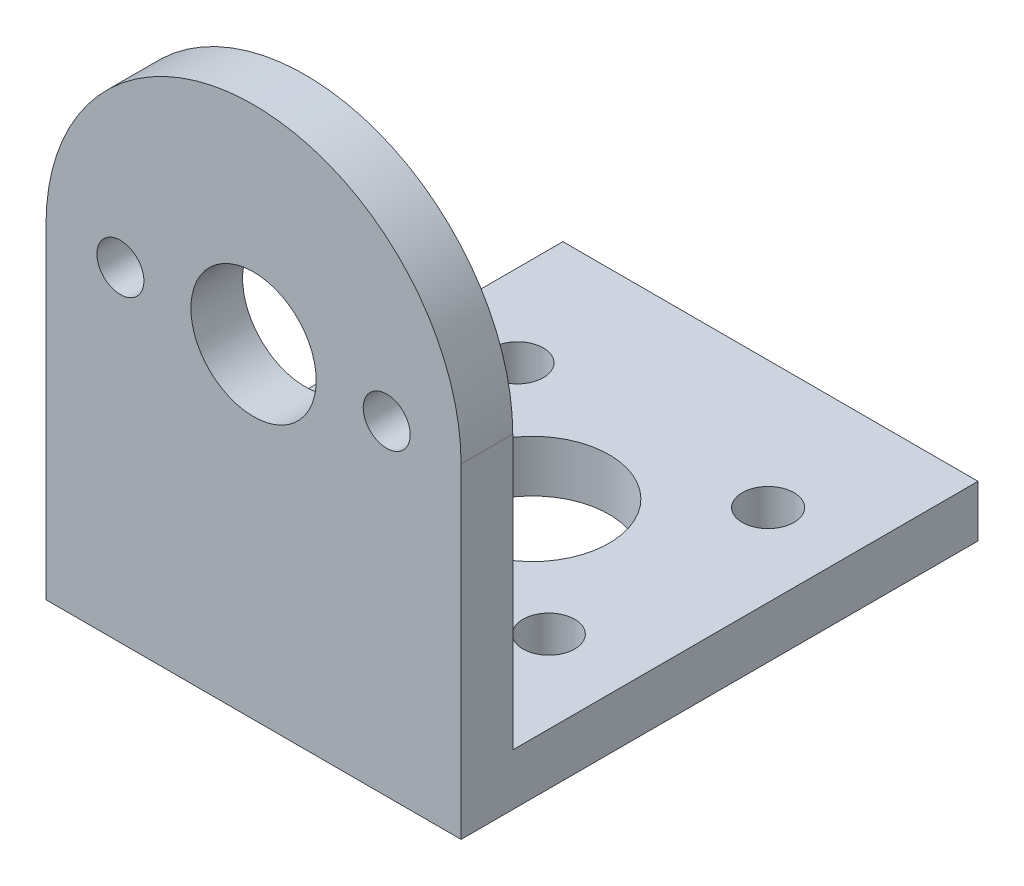
ISO-10303-21;
HEADER;
FILE_DESCRIPTION(('STEP AP214'),'2;1');
FILE_NAME('part.step','',(''),(''),'','','');
FILE_SCHEMA(('AUTOMOTIVE_DESIGN { 1 0 10303 214 1 1 1 1 }'));
ENDSEC;
DATA;
#1=APPLICATION_CONTEXT('core data for automotive mechanical design processes');
#2=APPLICATION_PROTOCOL_DEFINITION('international standard','automotive_design',2000,#1);
#3=PRODUCT_CONTEXT('',#1,'mechanical');
#4=PRODUCT('Part','Part','',(#3));
#5=PRODUCT_RELATED_PRODUCT_CATEGORY('part','',(#4));
#6=PRODUCT_DEFINITION_FORMATION('','',#4);
#7=PRODUCT_DEFINITION_CONTEXT('part definition',#1,'design');
#8=PRODUCT_DEFINITION('design','',#6,#7);
#9=PRODUCT_DEFINITION_SHAPE('','',#8);
#10=(LENGTH_UNIT() NAMED_UNIT(*) SI_UNIT(.MILLI.,.METRE.));
#11=(NAMED_UNIT(*) PLANE_ANGLE_UNIT() SI_UNIT($,.RADIAN.));
#12=(NAMED_UNIT(*) SI_UNIT($,.STERADIAN.) SOLID_ANGLE_UNIT());
#13=UNCERTAINTY_MEASURE_WITH_UNIT(LENGTH_MEASURE(1.E-05),#10,'distance_accuracy_value','');
#14=(GEOMETRIC_REPRESENTATION_CONTEXT(3) GLOBAL_UNCERTAINTY_ASSIGNED_CONTEXT((#13)) GLOBAL_UNIT_ASSIGNED_CONTEXT((#10,
#11,#12)) REPRESENTATION_CONTEXT('',''));
#15=CARTESIAN_POINT('',(0.,0.,0.));
#16=DIRECTION('',(0.,0.,1.));
#17=DIRECTION('',(1.,0.,0.));
#18=AXIS2_PLACEMENT_3D('',#15,#16,#17);
#19=CARTESIAN_POINT('',(0.,0.,0.));
#20=DIRECTION('',(0.,0.,-1.));
#21=DIRECTION('',(-1.,0.,0.));
#22=AXIS2_PLACEMENT_3D('',#19,#20,#21);
#23=PLANE('',#22);
#24=CARTESIAN_POINT('',(-8.5,0.,0.));
#25=DIRECTION('',(0.,0.,1.));
#26=DIRECTION('',(1.,0.,0.));
#27=AXIS2_PLACEMENT_3D('',#24,#25,#26);
#28=CIRCLE('',#27,1.5);
#29=CARTESIAN_POINT('',(-7.,0.,0.));
#30=VERTEX_POINT('',#29);
#31=EDGE_CURVE('E130',#30,#30,#28,.T.);
#32=ORIENTED_EDGE('',*,*,#31,.T.);
#33=EDGE_LOOP('',(#32));
#34=FACE_BOUND('',#33,.T.);
#35=CARTESIAN_POINT('',(0.,0.,0.));
#36=DIRECTION('',(0.,0.,1.));
#37=DIRECTION('',(1.,0.,0.));
#38=AXIS2_PLACEMENT_3D('',#35,#36,#37);
#39=CIRCLE('',#38,4.);
#40=CARTESIAN_POINT('',(4.,0.,0.));
#41=VERTEX_POINT('',#40);
#42=EDGE_CURVE('E136',#41,#41,#39,.T.);
#43=ORIENTED_EDGE('',*,*,#42,.T.);
#44=EDGE_LOOP('',(#43));
#45=FACE_BOUND('',#44,.T.);
#46=CARTESIAN_POINT('',(8.5,0.,0.));
#47=DIRECTION('',(0.,0.,1.));
#48=DIRECTION('',(-1.,0.,0.));
#49=AXIS2_PLACEMENT_3D('',#46,#47,#48);
#50=CIRCLE('',#49,1.5);
#51=CARTESIAN_POINT('',(7.,0.,0.));
#52=VERTEX_POINT('',#51);
#53=EDGE_CURVE('E125',#52,#52,#50,.T.);
#54=ORIENTED_EDGE('',*,*,#53,.T.);
#55=EDGE_LOOP('',(#54));
#56=FACE_BOUND('',#55,.T.);
#57=DIRECTION('',(0.,1.,0.));
#58=VECTOR('',#57,1.);
#59=CARTESIAN_POINT('',(13.25,0.,0.));
#60=LINE('',#59,#58);
#61=CARTESIAN_POINT('',(13.25,-17.45,0.));
#62=VERTEX_POINT('',#61);
#63=CARTESIAN_POINT('',(13.25,0.,0.));
#64=VERTEX_POINT('',#63);
#65=EDGE_CURVE('E76',#62,#64,#60,.T.);
#66=ORIENTED_EDGE('',*,*,#65,.F.);
#67=DIRECTION('',(-1.,0.,0.));
#68=VECTOR('',#67,1.);
#69=CARTESIAN_POINT('',(13.25,-17.45,0.));
#70=LINE('',#69,#68);
#71=CARTESIAN_POINT('',(-13.25,-17.45,0.));
#72=VERTEX_POINT('',#71);
#73=EDGE_CURVE('E100',#62,#72,#70,.T.);
#74=ORIENTED_EDGE('',*,*,#73,.T.);
#75=DIRECTION('',(0.,-1.,0.));
#76=VECTOR('',#75,1.);
#77=CARTESIAN_POINT('',(-13.25,0.,0.));
#78=LINE('',#77,#76);
#79=CARTESIAN_POINT('',(-13.25,0.,0.));
#80=VERTEX_POINT('',#79);
#81=EDGE_CURVE('E154',#80,#72,#78,.T.);
#82=ORIENTED_EDGE('',*,*,#81,.F.);
#83=CARTESIAN_POINT('',(0.,0.,0.));
#84=DIRECTION('',(0.,0.,1.));
#85=DIRECTION('',(-1.,0.,0.));
#86=AXIS2_PLACEMENT_3D('',#83,#84,#85);
#87=CIRCLE('',#86,13.25);
#88=EDGE_CURVE('E142',#64,#80,#87,.T.);
#89=ORIENTED_EDGE('',*,*,#88,.F.);
#90=EDGE_LOOP('',(#66,#74,#82,#89));
#91=FACE_BOUND('',#90,.T.);
#92=ADVANCED_FACE('F37',(#34,#45,#56,#91),#23,.T.);
#93=CARTESIAN_POINT('',(0.,0.,3.3));
#94=DIRECTION('',(0.,0.,-1.));
#95=DIRECTION('',(-1.,0.,0.));
#96=AXIS2_PLACEMENT_3D('',#93,#94,#95);
#97=PLANE('',#96);
#98=CARTESIAN_POINT('',(0.,0.,3.3));
#99=DIRECTION('',(0.,0.,1.));
#100=DIRECTION('',(-1.,0.,0.));
#101=AXIS2_PLACEMENT_3D('',#98,#99,#100);
#102=CIRCLE('',#101,13.25);
#103=CARTESIAN_POINT('',(13.25,0.,3.3));
#104=VERTEX_POINT('',#103);
#105=CARTESIAN_POINT('',(-13.25,0.,3.3));
#106=VERTEX_POINT('',#105);
#107=EDGE_CURVE('E145',#104,#106,#102,.T.);
#108=ORIENTED_EDGE('',*,*,#107,.T.);
#109=DIRECTION('',(0.,-1.,0.));
#110=VECTOR('',#109,1.);
#111=CARTESIAN_POINT('',(-13.25,0.,3.3));
#112=LINE('',#111,#110);
#113=CARTESIAN_POINT('',(-13.25,-20.75,3.3));
#114=VERTEX_POINT('',#113);
#115=EDGE_CURVE('E83',#106,#114,#112,.T.);
#116=ORIENTED_EDGE('',*,*,#115,.T.);
#117=DIRECTION('',(1.,0.,0.));
#118=VECTOR('',#117,1.);
#119=CARTESIAN_POINT('',(-13.25,-20.75,3.3));
#120=LINE('',#119,#118);
#121=CARTESIAN_POINT('',(13.25,-20.75,3.3));
#122=VERTEX_POINT('',#121);
#123=EDGE_CURVE('E148',#114,#122,#120,.T.);
#124=ORIENTED_EDGE('',*,*,#123,.T.);
#125=DIRECTION('',(0.,1.,0.));
#126=VECTOR('',#125,1.);
#127=CARTESIAN_POINT('',(13.25,0.,3.3));
#128=LINE('',#127,#126);
#129=EDGE_CURVE('E61',#122,#104,#128,.T.);
#130=ORIENTED_EDGE('',*,*,#129,.T.);
#131=EDGE_LOOP('',(#108,#116,#124,#130));
#132=FACE_BOUND('',#131,.T.);
#133=CARTESIAN_POINT('',(0.,0.,3.3));
#134=DIRECTION('',(0.,0.,1.));
#135=DIRECTION('',(1.,0.,0.));
#136=AXIS2_PLACEMENT_3D('',#133,#134,#135);
#137=CIRCLE('',#136,4.);
#138=CARTESIAN_POINT('',(4.,0.,3.3));
#139=VERTEX_POINT('',#138);
#140=EDGE_CURVE('E139',#139,#139,#137,.T.);
#141=ORIENTED_EDGE('',*,*,#140,.F.);
#142=EDGE_LOOP('',(#141));
#143=FACE_BOUND('',#142,.T.);
#144=CARTESIAN_POINT('',(-8.5,0.,3.3));
#145=DIRECTION('',(0.,0.,1.));
#146=DIRECTION('',(1.,0.,0.));
#147=AXIS2_PLACEMENT_3D('',#144,#145,#146);
#148=CIRCLE('',#147,1.5);
#149=CARTESIAN_POINT('',(-7.,0.,3.3));
#150=VERTEX_POINT('',#149);
#151=EDGE_CURVE('E133',#150,#150,#148,.T.);
#152=ORIENTED_EDGE('',*,*,#151,.F.);
#153=EDGE_LOOP('',(#152));
#154=FACE_BOUND('',#153,.T.);
#155=CARTESIAN_POINT('',(8.5,0.,3.3));
#156=DIRECTION('',(0.,0.,1.));
#157=DIRECTION('',(-1.,0.,0.));
#158=AXIS2_PLACEMENT_3D('',#155,#156,#157);
#159=CIRCLE('',#158,1.5);
#160=CARTESIAN_POINT('',(7.,0.,3.3));
#161=VERTEX_POINT('',#160);
#162=EDGE_CURVE('E127',#161,#161,#159,.T.);
#163=ORIENTED_EDGE('',*,*,#162,.F.);
#164=EDGE_LOOP('',(#163));
#165=FACE_BOUND('',#164,.T.);
#166=ADVANCED_FACE('F168',(#132,#143,#154,#165),#97,.F.);
#167=CARTESIAN_POINT('',(0.,0.,3.3));
#168=DIRECTION('',(0.,0.,-1.));
#169=DIRECTION('',(-1.,0.,0.));
#170=AXIS2_PLACEMENT_3D('',#167,#168,#169);
#171=CYLINDRICAL_SURFACE('',#170,13.25);
#172=ORIENTED_EDGE('',*,*,#88,.T.);
#173=DIRECTION('',(0.,0.,-1.));
#174=VECTOR('',#173,1.);
#175=CARTESIAN_POINT('',(-13.25,0.,3.3));
#176=LINE('',#175,#174);
#177=EDGE_CURVE('E11',#106,#80,#176,.T.);
#178=ORIENTED_EDGE('',*,*,#177,.F.);
#179=ORIENTED_EDGE('',*,*,#107,.F.);
#180=DIRECTION('',(0.,0.,-1.));
#181=VECTOR('',#180,1.);
#182=CARTESIAN_POINT('',(13.25,0.,3.3));
#183=LINE('',#182,#181);
#184=EDGE_CURVE('E151',#104,#64,#183,.T.);
#185=ORIENTED_EDGE('',*,*,#184,.T.);
#186=EDGE_LOOP('',(#172,#178,#179,#185));
#187=FACE_BOUND('',#186,.T.);
#188=ADVANCED_FACE('F39',(#187),#171,.T.);
#189=CARTESIAN_POINT('',(-13.25,0.,3.3));
#190=DIRECTION('',(1.,0.,0.));
#191=DIRECTION('',(0.,1.,0.));
#192=AXIS2_PLACEMENT_3D('',#189,#190,#191);
#193=PLANE('',#192);
#194=ORIENTED_EDGE('',*,*,#81,.T.);
#195=DIRECTION('',(0.,0.,1.));
#196=VECTOR('',#195,1.);
#197=CARTESIAN_POINT('',(-13.25,-17.45,-29.7));
#198=LINE('',#197,#196);
#199=CARTESIAN_POINT('',(-13.25,-17.45,-29.7));
#200=VERTEX_POINT('',#199);
#201=EDGE_CURVE('E52',#200,#72,#198,.T.);
#202=ORIENTED_EDGE('',*,*,#201,.F.);
#203=DIRECTION('',(0.,-1.,0.));
#204=VECTOR('',#203,1.);
#205=CARTESIAN_POINT('',(-13.25,-20.75,-29.7));
#206=LINE('',#205,#204);
#207=CARTESIAN_POINT('',(-13.25,-20.75,-29.7));
#208=VERTEX_POINT('',#207);
#209=EDGE_CURVE('E112',#200,#208,#206,.T.);
#210=ORIENTED_EDGE('',*,*,#209,.T.);
#211=DIRECTION('',(0.,0.,-1.));
#212=VECTOR('',#211,1.);
#213=CARTESIAN_POINT('',(-13.25,-20.75,3.3));
#214=LINE('',#213,#212);
#215=EDGE_CURVE('E45',#114,#208,#214,.T.);
#216=ORIENTED_EDGE('',*,*,#215,.F.);
#217=ORIENTED_EDGE('',*,*,#115,.F.);
#218=ORIENTED_EDGE('',*,*,#177,.T.);
#219=EDGE_LOOP('',(#194,#202,#210,#216,#217,#218));
#220=FACE_BOUND('',#219,.T.);
#221=ADVANCED_FACE('F162',(#220),#193,.F.);
#222=CARTESIAN_POINT('',(-13.25,-20.75,3.3));
#223=DIRECTION('',(0.,1.,0.));
#224=DIRECTION('',(0.,0.,1.));
#225=AXIS2_PLACEMENT_3D('',#222,#223,#224);
#226=PLANE('',#225);
#227=CARTESIAN_POINT('',(8.,-20.75,-21.55));
#228=DIRECTION('',(0.,1.,0.));
#229=DIRECTION('',(0.,0.,1.));
#230=AXIS2_PLACEMENT_3D('',#227,#228,#229);
#231=CIRCLE('',#230,1.65);
#232=CARTESIAN_POINT('',(8.,-20.75,-19.9));
#233=VERTEX_POINT('',#232);
#234=EDGE_CURVE('E333',#233,#233,#231,.F.);
#235=ORIENTED_EDGE('',*,*,#234,.F.);
#236=EDGE_LOOP('',(#235));
#237=FACE_BOUND('',#236,.T.);
#238=CARTESIAN_POINT('',(8.,-20.75,-7.55));
#239=DIRECTION('',(0.,1.,0.));
#240=DIRECTION('',(0.,0.,1.));
#241=AXIS2_PLACEMENT_3D('',#238,#239,#240);
#242=CIRCLE('',#241,1.65);
#243=CARTESIAN_POINT('',(8.,-20.75,-5.9));
#244=VERTEX_POINT('',#243);
#245=EDGE_CURVE('E341',#244,#244,#242,.F.);
#246=ORIENTED_EDGE('',*,*,#245,.F.);
#247=EDGE_LOOP('',(#246));
#248=FACE_BOUND('',#247,.T.);
#249=CARTESIAN_POINT('',(-7.99999999999999,-20.75,-7.55));
#250=DIRECTION('',(0.,1.,0.));
#251=DIRECTION('',(0.,0.,1.));
#252=AXIS2_PLACEMENT_3D('',#249,#250,#251);
#253=CIRCLE('',#252,1.65);
#254=CARTESIAN_POINT('',(-7.99999999999999,-20.75,-5.9));
#255=VERTEX_POINT('',#254);
#256=EDGE_CURVE('E354',#255,#255,#253,.F.);
#257=ORIENTED_EDGE('',*,*,#256,.F.);
#258=EDGE_LOOP('',(#257));
#259=FACE_BOUND('',#258,.T.);
#260=CARTESIAN_POINT('',(-8.,-20.75,-21.55));
#261=DIRECTION('',(0.,1.,0.));
#262=DIRECTION('',(0.,0.,1.));
#263=AXIS2_PLACEMENT_3D('',#260,#261,#262);
#264=CIRCLE('',#263,1.65);
#265=CARTESIAN_POINT('',(-8.,-20.75,-19.9));
#266=VERTEX_POINT('',#265);
#267=EDGE_CURVE('E345',#266,#266,#264,.F.);
#268=ORIENTED_EDGE('',*,*,#267,.F.);
#269=EDGE_LOOP('',(#268));
#270=FACE_BOUND('',#269,.T.);
#271=CARTESIAN_POINT('',(0.,-20.75,-14.5));
#272=DIRECTION('',(0.,1.,0.));
#273=DIRECTION('',(0.,0.,1.));
#274=AXIS2_PLACEMENT_3D('',#271,#272,#273);
#275=CIRCLE('',#274,4.9);
#276=CARTESIAN_POINT('',(0.,-20.75,-9.6));
#277=VERTEX_POINT('',#276);
#278=EDGE_CURVE('E118',#277,#277,#275,.F.);
#279=ORIENTED_EDGE('',*,*,#278,.F.);
#280=EDGE_LOOP('',(#279));
#281=FACE_BOUND('',#280,.T.);
#282=ORIENTED_EDGE('',*,*,#215,.T.);
#283=DIRECTION('',(1.,0.,0.));
#284=VECTOR('',#283,1.);
#285=CARTESIAN_POINT('',(13.25,-20.75,-29.7));
#286=LINE('',#285,#284);
#287=CARTESIAN_POINT('',(13.25,-20.75,-29.7));
#288=VERTEX_POINT('',#287);
#289=EDGE_CURVE('E102',#208,#288,#286,.T.);
#290=ORIENTED_EDGE('',*,*,#289,.T.);
#291=DIRECTION('',(0.,0.,-1.));
#292=VECTOR('',#291,1.);
#293=CARTESIAN_POINT('',(13.25,-20.75,3.3));
#294=LINE('',#293,#292);
#295=EDGE_CURVE('E116',#122,#288,#294,.T.);
#296=ORIENTED_EDGE('',*,*,#295,.F.);
#297=ORIENTED_EDGE('',*,*,#123,.F.);
#298=EDGE_LOOP('',(#282,#290,#296,#297));
#299=FACE_BOUND('',#298,.T.);
#300=ADVANCED_FACE('F161',(#237,#248,#259,#270,#281,#299),#226,.F.);
#301=CARTESIAN_POINT('',(13.25,0.,3.3));
#302=DIRECTION('',(-1.,0.,0.));
#303=DIRECTION('',(0.,-1.,0.));
#304=AXIS2_PLACEMENT_3D('',#301,#302,#303);
#305=PLANE('',#304);
#306=ORIENTED_EDGE('',*,*,#295,.T.);
#307=DIRECTION('',(0.,1.,0.));
#308=VECTOR('',#307,1.);
#309=CARTESIAN_POINT('',(13.25,-20.75,-29.7));
#310=LINE('',#309,#308);
#311=CARTESIAN_POINT('',(13.25,-17.45,-29.7));
#312=VERTEX_POINT('',#311);
#313=EDGE_CURVE('E109',#288,#312,#310,.T.);
#314=ORIENTED_EDGE('',*,*,#313,.T.);
#315=DIRECTION('',(0.,0.,1.));
#316=VECTOR('',#315,1.);
#317=CARTESIAN_POINT('',(13.25,-17.45,-29.7));
#318=LINE('',#317,#316);
#319=EDGE_CURVE('E96',#312,#62,#318,.T.);
#320=ORIENTED_EDGE('',*,*,#319,.T.);
#321=ORIENTED_EDGE('',*,*,#65,.T.);
#322=ORIENTED_EDGE('',*,*,#184,.F.);
#323=ORIENTED_EDGE('',*,*,#129,.F.);
#324=EDGE_LOOP('',(#306,#314,#320,#321,#322,#323));
#325=FACE_BOUND('',#324,.T.);
#326=ADVANCED_FACE('F114',(#325),#305,.F.);
#327=CARTESIAN_POINT('',(0.,0.,3.3));
#328=DIRECTION('',(0.,0.,-1.));
#329=DIRECTION('',(-1.,0.,0.));
#330=AXIS2_PLACEMENT_3D('',#327,#328,#329);
#331=CYLINDRICAL_SURFACE('',#330,4.);
#332=ORIENTED_EDGE('',*,*,#140,.T.);
#333=EDGE_LOOP('',(#332));
#334=FACE_BOUND('',#333,.T.);
#335=ORIENTED_EDGE('',*,*,#42,.F.);
#336=EDGE_LOOP('',(#335));
#337=FACE_BOUND('',#336,.T.);
#338=ADVANCED_FACE('F195',(#334,#337),#331,.F.);
#339=CARTESIAN_POINT('',(-8.5,0.,3.3));
#340=DIRECTION('',(0.,0.,-1.));
#341=DIRECTION('',(-1.,0.,0.));
#342=AXIS2_PLACEMENT_3D('',#339,#340,#341);
#343=CYLINDRICAL_SURFACE('',#342,1.5);
#344=ORIENTED_EDGE('',*,*,#151,.T.);
#345=EDGE_LOOP('',(#344));
#346=FACE_BOUND('',#345,.T.);
#347=ORIENTED_EDGE('',*,*,#31,.F.);
#348=EDGE_LOOP('',(#347));
#349=FACE_BOUND('',#348,.T.);
#350=ADVANCED_FACE('F181',(#346,#349),#343,.F.);
#351=CARTESIAN_POINT('',(8.5,0.,3.3));
#352=DIRECTION('',(0.,0.,-1.));
#353=DIRECTION('',(-1.,0.,0.));
#354=AXIS2_PLACEMENT_3D('',#351,#352,#353);
#355=CYLINDRICAL_SURFACE('',#354,1.5);
#356=ORIENTED_EDGE('',*,*,#162,.T.);
#357=EDGE_LOOP('',(#356));
#358=FACE_BOUND('',#357,.T.);
#359=ORIENTED_EDGE('',*,*,#53,.F.);
#360=EDGE_LOOP('',(#359));
#361=FACE_BOUND('',#360,.T.);
#362=ADVANCED_FACE('F178',(#358,#361),#355,.F.);
#363=CARTESIAN_POINT('',(13.25,-17.45,-29.7));
#364=DIRECTION('',(0.,1.,0.));
#365=DIRECTION('',(-1.,0.,0.));
#366=AXIS2_PLACEMENT_3D('',#363,#364,#365);
#367=PLANE('',#366);
#368=CARTESIAN_POINT('',(8.,-17.45,-21.55));
#369=DIRECTION('',(0.,1.,0.));
#370=DIRECTION('',(1.,0.,0.));
#371=AXIS2_PLACEMENT_3D('',#368,#369,#370);
#372=CIRCLE('',#371,1.65);
#373=CARTESIAN_POINT('',(9.65,-17.45,-21.55));
#374=VERTEX_POINT('',#373);
#375=EDGE_CURVE('E336',#374,#374,#372,.T.);
#376=ORIENTED_EDGE('',*,*,#375,.F.);
#377=EDGE_LOOP('',(#376));
#378=FACE_BOUND('',#377,.T.);
#379=CARTESIAN_POINT('',(8.,-17.45,-7.55));
#380=DIRECTION('',(0.,1.,0.));
#381=DIRECTION('',(1.,0.,0.));
#382=AXIS2_PLACEMENT_3D('',#379,#380,#381);
#383=CIRCLE('',#382,1.65);
#384=CARTESIAN_POINT('',(9.65,-17.45,-7.55));
#385=VERTEX_POINT('',#384);
#386=EDGE_CURVE('E338',#385,#385,#383,.T.);
#387=ORIENTED_EDGE('',*,*,#386,.F.);
#388=EDGE_LOOP('',(#387));
#389=FACE_BOUND('',#388,.T.);
#390=CARTESIAN_POINT('',(-7.99999999999999,-17.45,-7.55));
#391=DIRECTION('',(0.,1.,0.));
#392=DIRECTION('',(-1.,0.,0.));
#393=AXIS2_PLACEMENT_3D('',#390,#391,#392);
#394=CIRCLE('',#393,1.65);
#395=CARTESIAN_POINT('',(-9.65,-17.45,-7.55));
#396=VERTEX_POINT('',#395);
#397=EDGE_CURVE('E357',#396,#396,#394,.T.);
#398=ORIENTED_EDGE('',*,*,#397,.F.);
#399=EDGE_LOOP('',(#398));
#400=FACE_BOUND('',#399,.T.);
#401=CARTESIAN_POINT('',(-8.,-17.45,-21.55));
#402=DIRECTION('',(0.,1.,0.));
#403=DIRECTION('',(-1.,0.,0.));
#404=AXIS2_PLACEMENT_3D('',#401,#402,#403);
#405=CIRCLE('',#404,1.65);
#406=CARTESIAN_POINT('',(-9.65,-17.45,-21.55));
#407=VERTEX_POINT('',#406);
#408=EDGE_CURVE('E350',#407,#407,#405,.T.);
#409=ORIENTED_EDGE('',*,*,#408,.F.);
#410=EDGE_LOOP('',(#409));
#411=FACE_BOUND('',#410,.T.);
#412=CARTESIAN_POINT('',(0.,-17.45,-14.5));
#413=DIRECTION('',(0.,1.,0.));
#414=DIRECTION('',(-1.,0.,0.));
#415=AXIS2_PLACEMENT_3D('',#412,#413,#414);
#416=CIRCLE('',#415,4.9);
#417=CARTESIAN_POINT('',(-4.9,-17.45,-14.5));
#418=VERTEX_POINT('',#417);
#419=EDGE_CURVE('E343',#418,#418,#416,.T.);
#420=ORIENTED_EDGE('',*,*,#419,.F.);
#421=EDGE_LOOP('',(#420));
#422=FACE_BOUND('',#421,.T.);
#423=ORIENTED_EDGE('',*,*,#73,.F.);
#424=ORIENTED_EDGE('',*,*,#319,.F.);
#425=DIRECTION('',(-1.,0.,0.));
#426=VECTOR('',#425,1.);
#427=CARTESIAN_POINT('',(13.25,-17.45,-29.7));
#428=LINE('',#427,#426);
#429=EDGE_CURVE('E99',#312,#200,#428,.T.);
#430=ORIENTED_EDGE('',*,*,#429,.T.);
#431=ORIENTED_EDGE('',*,*,#201,.T.);
#432=EDGE_LOOP('',(#423,#424,#430,#431));
#433=FACE_BOUND('',#432,.T.);
#434=ADVANCED_FACE('F98',(#378,#389,#400,#411,#422,#433),#367,.T.);
#435=CARTESIAN_POINT('',(0.,0.,-29.7));
#436=DIRECTION('',(0.,0.,1.));
#437=DIRECTION('',(1.,0.,0.));
#438=AXIS2_PLACEMENT_3D('',#435,#436,#437);
#439=PLANE('',#438);
#440=ORIENTED_EDGE('',*,*,#313,.F.);
#441=ORIENTED_EDGE('',*,*,#289,.F.);
#442=ORIENTED_EDGE('',*,*,#209,.F.);
#443=ORIENTED_EDGE('',*,*,#429,.F.);
#444=EDGE_LOOP('',(#440,#441,#442,#443));
#445=FACE_BOUND('',#444,.T.);
#446=ADVANCED_FACE('F107',(#445),#439,.F.);
#447=CARTESIAN_POINT('',(0.,-34.6092929112563,-14.5));
#448=DIRECTION('',(0.,1.,0.));
#449=DIRECTION('',(-1.,0.,0.));
#450=AXIS2_PLACEMENT_3D('',#447,#448,#449);
#451=CYLINDRICAL_SURFACE('',#450,4.9);
#452=ORIENTED_EDGE('',*,*,#278,.T.);
#453=EDGE_LOOP('',(#452));
#454=FACE_BOUND('',#453,.T.);
#455=ORIENTED_EDGE('',*,*,#419,.T.);
#456=EDGE_LOOP('',(#455));
#457=FACE_BOUND('',#456,.T.);
#458=ADVANCED_FACE('F266',(#454,#457),#451,.F.);
#459=CARTESIAN_POINT('',(-7.99999999999999,-34.6092929112563,-21.55));
#460=DIRECTION('',(0.,1.,0.));
#461=DIRECTION('',(-1.,0.,0.));
#462=AXIS2_PLACEMENT_3D('',#459,#460,#461);
#463=CYLINDRICAL_SURFACE('',#462,1.65);
#464=ORIENTED_EDGE('',*,*,#267,.T.);
#465=EDGE_LOOP('',(#464));
#466=FACE_BOUND('',#465,.T.);
#467=ORIENTED_EDGE('',*,*,#408,.T.);
#468=EDGE_LOOP('',(#467));
#469=FACE_BOUND('',#468,.T.);
#470=ADVANCED_FACE('F286',(#466,#469),#463,.F.);
#471=CARTESIAN_POINT('',(-7.99999999999999,-34.6092929112563,-7.55));
#472=DIRECTION('',(0.,1.,0.));
#473=DIRECTION('',(-1.,0.,0.));
#474=AXIS2_PLACEMENT_3D('',#471,#472,#473);
#475=CYLINDRICAL_SURFACE('',#474,1.65);
#476=ORIENTED_EDGE('',*,*,#256,.T.);
#477=EDGE_LOOP('',(#476));
#478=FACE_BOUND('',#477,.T.);
#479=ORIENTED_EDGE('',*,*,#397,.T.);
#480=EDGE_LOOP('',(#479));
#481=FACE_BOUND('',#480,.T.);
#482=ADVANCED_FACE('F296',(#478,#481),#475,.F.);
#483=CARTESIAN_POINT('',(8.,-34.6092929112563,-7.55));
#484=DIRECTION('',(0.,1.,0.));
#485=DIRECTION('',(-1.,0.,0.));
#486=AXIS2_PLACEMENT_3D('',#483,#484,#485);
#487=CYLINDRICAL_SURFACE('',#486,1.65);
#488=ORIENTED_EDGE('',*,*,#245,.T.);
#489=EDGE_LOOP('',(#488));
#490=FACE_BOUND('',#489,.T.);
#491=ORIENTED_EDGE('',*,*,#386,.T.);
#492=EDGE_LOOP('',(#491));
#493=FACE_BOUND('',#492,.T.);
#494=ADVANCED_FACE('F306',(#490,#493),#487,.F.);
#495=CARTESIAN_POINT('',(8.,-34.6092929112563,-21.55));
#496=DIRECTION('',(0.,1.,0.));
#497=DIRECTION('',(-1.,0.,0.));
#498=AXIS2_PLACEMENT_3D('',#495,#496,#497);
#499=CYLINDRICAL_SURFACE('',#498,1.65);
#500=ORIENTED_EDGE('',*,*,#234,.T.);
#501=EDGE_LOOP('',(#500));
#502=FACE_BOUND('',#501,.T.);
#503=ORIENTED_EDGE('',*,*,#375,.T.);
#504=EDGE_LOOP('',(#503));
#505=FACE_BOUND('',#504,.T.);
#506=ADVANCED_FACE('F316',(#502,#505),#499,.F.);
#507=CLOSED_SHELL('',(#92,#166,#188,#221,#300,#326,#338,#350,#362,#434,#446,#458,#470,#482,#494,#506));
#508=MANIFOLD_SOLID_BREP('B2',#507);
#509=ADVANCED_BREP_SHAPE_REPRESENTATION('',(#18,#508),#14);
#510=SHAPE_DEFINITION_REPRESENTATION(#9,#509);
ENDSEC;
END-ISO-10303-21;
